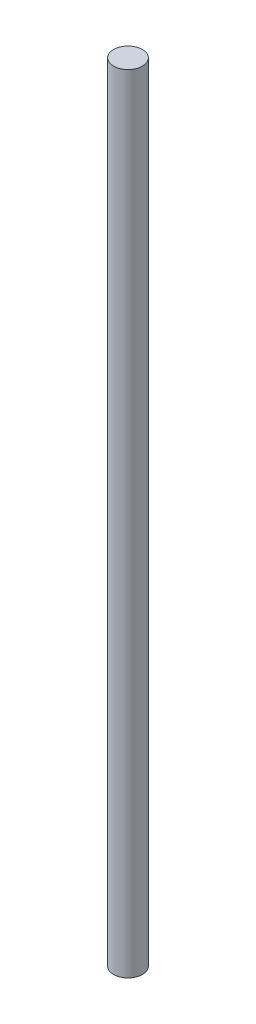
ISO-10303-21;
HEADER;
FILE_DESCRIPTION(('STEP AP214'),'2;1');
FILE_NAME('part.step','',(''),(''),'','','');
FILE_SCHEMA(('AUTOMOTIVE_DESIGN { 1 0 10303 214 1 1 1 1 }'));
ENDSEC;
DATA;
#1=APPLICATION_CONTEXT('core data for automotive mechanical design processes');
#2=APPLICATION_PROTOCOL_DEFINITION('international standard','automotive_design',2000,#1);
#3=PRODUCT_CONTEXT('',#1,'mechanical');
#4=PRODUCT('Part','Part','',(#3));
#5=PRODUCT_RELATED_PRODUCT_CATEGORY('part','',(#4));
#6=PRODUCT_DEFINITION_FORMATION('','',#4);
#7=PRODUCT_DEFINITION_CONTEXT('part definition',#1,'design');
#8=PRODUCT_DEFINITION('design','',#6,#7);
#9=PRODUCT_DEFINITION_SHAPE('','',#8);
#10=(LENGTH_UNIT() NAMED_UNIT(*) SI_UNIT(.MILLI.,.METRE.));
#11=(NAMED_UNIT(*) PLANE_ANGLE_UNIT() SI_UNIT($,.RADIAN.));
#12=(NAMED_UNIT(*) SI_UNIT($,.STERADIAN.) SOLID_ANGLE_UNIT());
#13=UNCERTAINTY_MEASURE_WITH_UNIT(LENGTH_MEASURE(1.E-05),#10,'distance_accuracy_value','');
#14=(GEOMETRIC_REPRESENTATION_CONTEXT(3) GLOBAL_UNCERTAINTY_ASSIGNED_CONTEXT((#13)) GLOBAL_UNIT_ASSIGNED_CONTEXT((#10,
#11,#12)) REPRESENTATION_CONTEXT('',''));
#15=CARTESIAN_POINT('',(0.,0.,0.));
#16=DIRECTION('',(0.,0.,1.));
#17=DIRECTION('',(1.,0.,0.));
#18=AXIS2_PLACEMENT_3D('',#15,#16,#17);
#19=CARTESIAN_POINT('',(0.,600.,0.));
#20=DIRECTION('',(0.,-1.,0.));
#21=DIRECTION('',(0.,0.,-1.));
#22=AXIS2_PLACEMENT_3D('',#19,#20,#21);
#23=CYLINDRICAL_SURFACE('',#22,11.);
#24=CARTESIAN_POINT('',(0.,600.,0.));
#25=DIRECTION('',(0.,1.,0.));
#26=DIRECTION('',(0.,0.,1.));
#27=AXIS2_PLACEMENT_3D('',#24,#25,#26);
#28=CIRCLE('',#27,11.);
#29=CARTESIAN_POINT('',(0.,600.,11.));
#30=VERTEX_POINT('',#29);
#31=EDGE_CURVE('E10',#30,#30,#28,.T.);
#32=ORIENTED_EDGE('',*,*,#31,.F.);
#33=EDGE_LOOP('',(#32));
#34=FACE_BOUND('',#33,.T.);
#35=CARTESIAN_POINT('',(0.,0.,0.));
#36=DIRECTION('',(0.,1.,0.));
#37=DIRECTION('',(0.,0.,1.));
#38=AXIS2_PLACEMENT_3D('',#35,#36,#37);
#39=CIRCLE('',#38,11.);
#40=CARTESIAN_POINT('',(0.,0.,11.));
#41=VERTEX_POINT('',#40);
#42=EDGE_CURVE('E34',#41,#41,#39,.T.);
#43=ORIENTED_EDGE('',*,*,#42,.T.);
#44=EDGE_LOOP('',(#43));
#45=FACE_BOUND('',#44,.T.);
#46=ADVANCED_FACE('F31',(#34,#45),#23,.T.);
#47=CARTESIAN_POINT('',(0.,600.,0.));
#48=DIRECTION('',(0.,1.,0.));
#49=DIRECTION('',(0.,0.,1.));
#50=AXIS2_PLACEMENT_3D('',#47,#48,#49);
#51=PLANE('',#50);
#52=ORIENTED_EDGE('',*,*,#31,.T.);
#53=EDGE_LOOP('',(#52));
#54=FACE_BOUND('',#53,.T.);
#55=ADVANCED_FACE('F46',(#54),#51,.T.);
#56=CARTESIAN_POINT('',(0.,0.,0.));
#57=DIRECTION('',(0.,1.,0.));
#58=DIRECTION('',(0.,0.,1.));
#59=AXIS2_PLACEMENT_3D('',#56,#57,#58);
#60=PLANE('',#59);
#61=ORIENTED_EDGE('',*,*,#42,.F.);
#62=EDGE_LOOP('',(#61));
#63=FACE_BOUND('',#62,.T.);
#64=ADVANCED_FACE('F44',(#63),#60,.F.);
#65=CLOSED_SHELL('',(#46,#55,#64));
#66=MANIFOLD_SOLID_BREP('B2',#65);
#67=ADVANCED_BREP_SHAPE_REPRESENTATION('',(#18,#66),#14);
#68=SHAPE_DEFINITION_REPRESENTATION(#9,#67);
ENDSEC;
END-ISO-10303-21;
